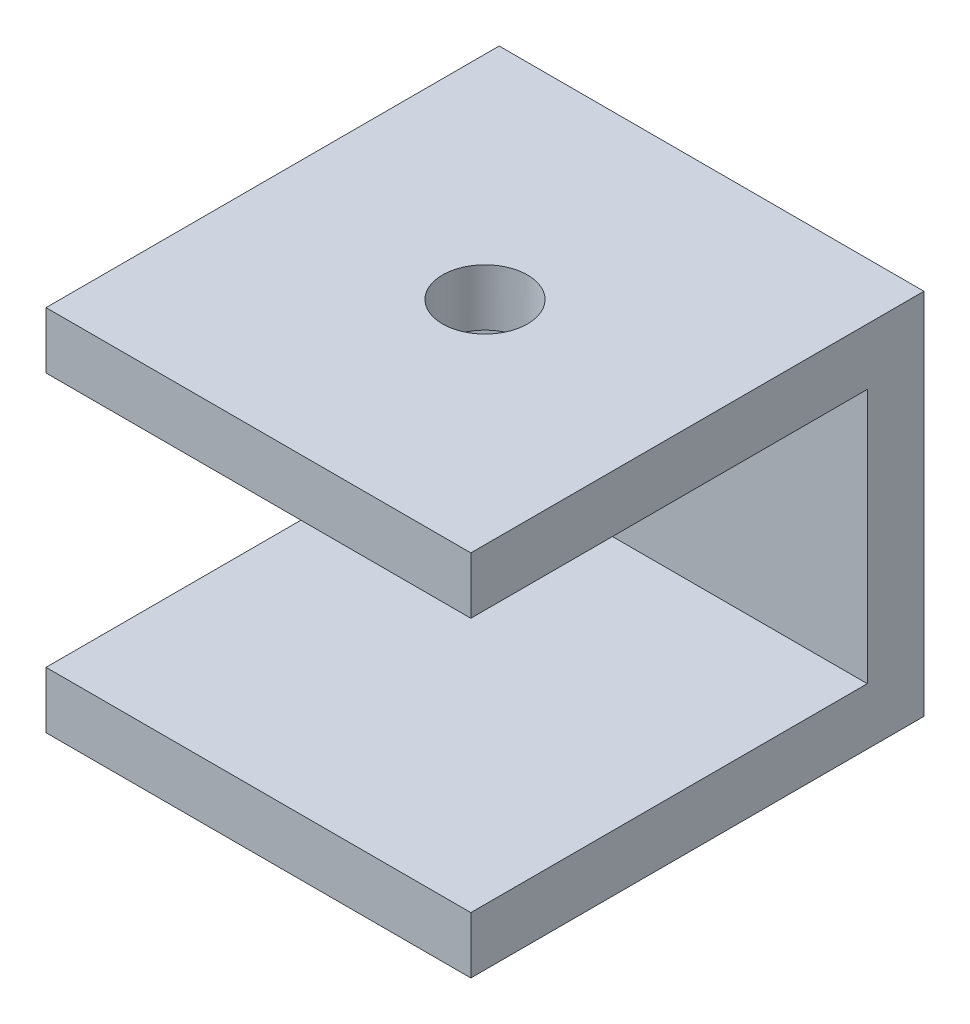
ISO-10303-21;
HEADER;
FILE_DESCRIPTION(('STEP AP214'),'2;1');
FILE_NAME('part.step','',(''),(''),'','','');
FILE_SCHEMA(('AUTOMOTIVE_DESIGN { 1 0 10303 214 1 1 1 1 }'));
ENDSEC;
DATA;
#1=APPLICATION_CONTEXT('core data for automotive mechanical design processes');
#2=APPLICATION_PROTOCOL_DEFINITION('international standard','automotive_design',2000,#1);
#3=PRODUCT_CONTEXT('',#1,'mechanical');
#4=PRODUCT('Part','Part','',(#3));
#5=PRODUCT_RELATED_PRODUCT_CATEGORY('part','',(#4));
#6=PRODUCT_DEFINITION_FORMATION('','',#4);
#7=PRODUCT_DEFINITION_CONTEXT('part definition',#1,'design');
#8=PRODUCT_DEFINITION('design','',#6,#7);
#9=PRODUCT_DEFINITION_SHAPE('','',#8);
#10=(LENGTH_UNIT() NAMED_UNIT(*) SI_UNIT(.MILLI.,.METRE.));
#11=(NAMED_UNIT(*) PLANE_ANGLE_UNIT() SI_UNIT($,.RADIAN.));
#12=(NAMED_UNIT(*) SI_UNIT($,.STERADIAN.) SOLID_ANGLE_UNIT());
#13=UNCERTAINTY_MEASURE_WITH_UNIT(LENGTH_MEASURE(1.E-05),#10,'distance_accuracy_value','');
#14=(GEOMETRIC_REPRESENTATION_CONTEXT(3) GLOBAL_UNCERTAINTY_ASSIGNED_CONTEXT((#13)) GLOBAL_UNIT_ASSIGNED_CONTEXT((#10,
#11,#12)) REPRESENTATION_CONTEXT('',''));
#15=CARTESIAN_POINT('',(0.,0.,0.));
#16=DIRECTION('',(0.,0.,1.));
#17=DIRECTION('',(1.,0.,0.));
#18=AXIS2_PLACEMENT_3D('',#15,#16,#17);
#19=CARTESIAN_POINT('',(-15.,0.,16.));
#20=DIRECTION('',(0.,1.,0.));
#21=DIRECTION('',(0.,0.,1.));
#22=AXIS2_PLACEMENT_3D('',#19,#20,#21);
#23=PLANE('',#22);
#24=CARTESIAN_POINT('',(-7.5,0.,8.));
#25=DIRECTION('',(0.,1.,0.));
#26=DIRECTION('',(0.,0.,1.));
#27=AXIS2_PLACEMENT_3D('',#24,#25,#26);
#28=CIRCLE('',#27,1.5);
#29=CARTESIAN_POINT('',(-7.5,0.,9.5));
#30=VERTEX_POINT('',#29);
#31=EDGE_CURVE('E134',#30,#30,#28,.T.);
#32=ORIENTED_EDGE('',*,*,#31,.F.);
#33=EDGE_LOOP('',(#32));
#34=FACE_BOUND('',#33,.T.);
#35=DIRECTION('',(0.,0.,1.));
#36=VECTOR('',#35,1.);
#37=CARTESIAN_POINT('',(0.,0.,16.));
#38=LINE('',#37,#36);
#39=CARTESIAN_POINT('',(0.,0.,0.));
#40=VERTEX_POINT('',#39);
#41=CARTESIAN_POINT('',(0.,0.,16.));
#42=VERTEX_POINT('',#41);
#43=EDGE_CURVE('E130',#40,#42,#38,.T.);
#44=ORIENTED_EDGE('',*,*,#43,.F.);
#45=DIRECTION('',(1.,0.,0.));
#46=VECTOR('',#45,1.);
#47=CARTESIAN_POINT('',(-15.,0.,0.));
#48=LINE('',#47,#46);
#49=CARTESIAN_POINT('',(-15.,0.,0.));
#50=VERTEX_POINT('',#49);
#51=EDGE_CURVE('E11',#50,#40,#48,.T.);
#52=ORIENTED_EDGE('',*,*,#51,.F.);
#53=DIRECTION('',(0.,0.,1.));
#54=VECTOR('',#53,1.);
#55=CARTESIAN_POINT('',(-15.,0.,16.));
#56=LINE('',#55,#54);
#57=CARTESIAN_POINT('',(-15.,0.,16.));
#58=VERTEX_POINT('',#57);
#59=EDGE_CURVE('E151',#50,#58,#56,.T.);
#60=ORIENTED_EDGE('',*,*,#59,.T.);
#61=DIRECTION('',(1.,0.,0.));
#62=VECTOR('',#61,1.);
#63=CARTESIAN_POINT('',(-15.,0.,16.));
#64=LINE('',#63,#62);
#65=EDGE_CURVE('E36',#58,#42,#64,.T.);
#66=ORIENTED_EDGE('',*,*,#65,.T.);
#67=EDGE_LOOP('',(#44,#52,#60,#66));
#68=FACE_BOUND('',#67,.T.);
#69=ADVANCED_FACE('F33',(#34,#68),#23,.T.);
#70=CARTESIAN_POINT('',(-15.,0.,0.));
#71=DIRECTION('',(0.,0.,-1.));
#72=DIRECTION('',(0.,1.,0.));
#73=AXIS2_PLACEMENT_3D('',#70,#71,#72);
#74=PLANE('',#73);
#75=DIRECTION('',(0.,1.,0.));
#76=VECTOR('',#75,1.);
#77=CARTESIAN_POINT('',(0.,0.,0.));
#78=LINE('',#77,#76);
#79=CARTESIAN_POINT('',(0.,-13.,0.));
#80=VERTEX_POINT('',#79);
#81=EDGE_CURVE('E149',#80,#40,#78,.T.);
#82=ORIENTED_EDGE('',*,*,#81,.F.);
#83=DIRECTION('',(1.,0.,0.));
#84=VECTOR('',#83,1.);
#85=CARTESIAN_POINT('',(-15.,-13.,0.));
#86=LINE('',#85,#84);
#87=CARTESIAN_POINT('',(-15.,-13.,0.));
#88=VERTEX_POINT('',#87);
#89=EDGE_CURVE('E42',#88,#80,#86,.T.);
#90=ORIENTED_EDGE('',*,*,#89,.F.);
#91=DIRECTION('',(0.,1.,0.));
#92=VECTOR('',#91,1.);
#93=CARTESIAN_POINT('',(-15.,0.,0.));
#94=LINE('',#93,#92);
#95=EDGE_CURVE('E120',#88,#50,#94,.T.);
#96=ORIENTED_EDGE('',*,*,#95,.T.);
#97=ORIENTED_EDGE('',*,*,#51,.T.);
#98=EDGE_LOOP('',(#82,#90,#96,#97));
#99=FACE_BOUND('',#98,.T.);
#100=ADVANCED_FACE('F163',(#99),#74,.T.);
#101=CARTESIAN_POINT('',(-15.,-13.,0.));
#102=DIRECTION('',(0.,-1.,0.));
#103=DIRECTION('',(0.,0.,-1.));
#104=AXIS2_PLACEMENT_3D('',#101,#102,#103);
#105=PLANE('',#104);
#106=DIRECTION('',(0.,0.,-1.));
#107=VECTOR('',#106,1.);
#108=CARTESIAN_POINT('',(0.,-13.,0.));
#109=LINE('',#108,#107);
#110=CARTESIAN_POINT('',(0.,-13.,16.));
#111=VERTEX_POINT('',#110);
#112=EDGE_CURVE('E107',#111,#80,#109,.T.);
#113=ORIENTED_EDGE('',*,*,#112,.F.);
#114=DIRECTION('',(1.,0.,0.));
#115=VECTOR('',#114,1.);
#116=CARTESIAN_POINT('',(-15.,-13.,16.));
#117=LINE('',#116,#115);
#118=CARTESIAN_POINT('',(-15.,-13.,16.));
#119=VERTEX_POINT('',#118);
#120=EDGE_CURVE('E102',#119,#111,#117,.T.);
#121=ORIENTED_EDGE('',*,*,#120,.F.);
#122=DIRECTION('',(0.,0.,-1.));
#123=VECTOR('',#122,1.);
#124=CARTESIAN_POINT('',(-15.,-13.,0.));
#125=LINE('',#124,#123);
#126=EDGE_CURVE('E105',#119,#88,#125,.T.);
#127=ORIENTED_EDGE('',*,*,#126,.T.);
#128=ORIENTED_EDGE('',*,*,#89,.T.);
#129=EDGE_LOOP('',(#113,#121,#127,#128));
#130=FACE_BOUND('',#129,.T.);
#131=ADVANCED_FACE('F104',(#130),#105,.T.);
#132=CARTESIAN_POINT('',(-15.,-13.,16.));
#133=DIRECTION('',(0.,0.,1.));
#134=DIRECTION('',(0.,-1.,0.));
#135=AXIS2_PLACEMENT_3D('',#132,#133,#134);
#136=PLANE('',#135);
#137=DIRECTION('',(0.,-1.,0.));
#138=VECTOR('',#137,1.);
#139=CARTESIAN_POINT('',(0.,-13.,16.));
#140=LINE('',#139,#138);
#141=CARTESIAN_POINT('',(0.,-11.,16.));
#142=VERTEX_POINT('',#141);
#143=EDGE_CURVE('E146',#142,#111,#140,.T.);
#144=ORIENTED_EDGE('',*,*,#143,.F.);
#145=DIRECTION('',(1.,0.,0.));
#146=VECTOR('',#145,1.);
#147=CARTESIAN_POINT('',(-15.,-11.,16.));
#148=LINE('',#147,#146);
#149=CARTESIAN_POINT('',(-15.,-11.,16.));
#150=VERTEX_POINT('',#149);
#151=EDGE_CURVE('E112',#150,#142,#148,.T.);
#152=ORIENTED_EDGE('',*,*,#151,.F.);
#153=DIRECTION('',(0.,-1.,0.));
#154=VECTOR('',#153,1.);
#155=CARTESIAN_POINT('',(-15.,-13.,16.));
#156=LINE('',#155,#154);
#157=EDGE_CURVE('E118',#150,#119,#156,.T.);
#158=ORIENTED_EDGE('',*,*,#157,.T.);
#159=ORIENTED_EDGE('',*,*,#120,.T.);
#160=EDGE_LOOP('',(#144,#152,#158,#159));
#161=FACE_BOUND('',#160,.T.);
#162=ADVANCED_FACE('F122',(#161),#136,.T.);
#163=CARTESIAN_POINT('',(-15.,-11.,16.));
#164=DIRECTION('',(0.,1.,0.));
#165=DIRECTION('',(0.,0.,1.));
#166=AXIS2_PLACEMENT_3D('',#163,#164,#165);
#167=PLANE('',#166);
#168=DIRECTION('',(0.,0.,1.));
#169=VECTOR('',#168,1.);
#170=CARTESIAN_POINT('',(0.,-11.,16.));
#171=LINE('',#170,#169);
#172=CARTESIAN_POINT('',(0.,-11.,2.));
#173=VERTEX_POINT('',#172);
#174=EDGE_CURVE('E143',#173,#142,#171,.T.);
#175=ORIENTED_EDGE('',*,*,#174,.F.);
#176=DIRECTION('',(1.,0.,0.));
#177=VECTOR('',#176,1.);
#178=CARTESIAN_POINT('',(-15.,-11.,2.));
#179=LINE('',#178,#177);
#180=CARTESIAN_POINT('',(-15.,-11.,2.));
#181=VERTEX_POINT('',#180);
#182=EDGE_CURVE('E155',#181,#173,#179,.T.);
#183=ORIENTED_EDGE('',*,*,#182,.F.);
#184=DIRECTION('',(0.,0.,1.));
#185=VECTOR('',#184,1.);
#186=CARTESIAN_POINT('',(-15.,-11.,16.));
#187=LINE('',#186,#185);
#188=EDGE_CURVE('E123',#181,#150,#187,.T.);
#189=ORIENTED_EDGE('',*,*,#188,.T.);
#190=ORIENTED_EDGE('',*,*,#151,.T.);
#191=EDGE_LOOP('',(#175,#183,#189,#190));
#192=FACE_BOUND('',#191,.T.);
#193=ADVANCED_FACE('F177',(#192),#167,.T.);
#194=CARTESIAN_POINT('',(-15.,-11.,2.));
#195=DIRECTION('',(0.,0.,1.));
#196=DIRECTION('',(0.,-1.,0.));
#197=AXIS2_PLACEMENT_3D('',#194,#195,#196);
#198=PLANE('',#197);
#199=DIRECTION('',(0.,-1.,0.));
#200=VECTOR('',#199,1.);
#201=CARTESIAN_POINT('',(0.,-11.,2.));
#202=LINE('',#201,#200);
#203=CARTESIAN_POINT('',(0.,-2.,2.));
#204=VERTEX_POINT('',#203);
#205=EDGE_CURVE('E140',#204,#173,#202,.T.);
#206=ORIENTED_EDGE('',*,*,#205,.F.);
#207=DIRECTION('',(1.,0.,0.));
#208=VECTOR('',#207,1.);
#209=CARTESIAN_POINT('',(-15.,-2.,2.));
#210=LINE('',#209,#208);
#211=CARTESIAN_POINT('',(-15.,-2.,2.));
#212=VERTEX_POINT('',#211);
#213=EDGE_CURVE('E157',#212,#204,#210,.T.);
#214=ORIENTED_EDGE('',*,*,#213,.F.);
#215=DIRECTION('',(0.,-1.,0.));
#216=VECTOR('',#215,1.);
#217=CARTESIAN_POINT('',(-15.,-11.,2.));
#218=LINE('',#217,#216);
#219=EDGE_CURVE('E125',#212,#181,#218,.T.);
#220=ORIENTED_EDGE('',*,*,#219,.T.);
#221=ORIENTED_EDGE('',*,*,#182,.T.);
#222=EDGE_LOOP('',(#206,#214,#220,#221));
#223=FACE_BOUND('',#222,.T.);
#224=ADVANCED_FACE('F180',(#223),#198,.T.);
#225=CARTESIAN_POINT('',(-15.,-2.,2.));
#226=DIRECTION('',(0.,-1.,0.));
#227=DIRECTION('',(0.,0.,-1.));
#228=AXIS2_PLACEMENT_3D('',#225,#226,#227);
#229=PLANE('',#228);
#230=CARTESIAN_POINT('',(-7.5,-2.,8.));
#231=DIRECTION('',(0.,-1.,0.));
#232=DIRECTION('',(0.,0.,-1.));
#233=AXIS2_PLACEMENT_3D('',#230,#231,#232);
#234=CIRCLE('',#233,1.5);
#235=CARTESIAN_POINT('',(-7.5,-2.,6.5));
#236=VERTEX_POINT('',#235);
#237=EDGE_CURVE('E204',#236,#236,#234,.F.);
#238=ORIENTED_EDGE('',*,*,#237,.T.);
#239=EDGE_LOOP('',(#238));
#240=FACE_BOUND('',#239,.T.);
#241=DIRECTION('',(0.,0.,-1.));
#242=VECTOR('',#241,1.);
#243=CARTESIAN_POINT('',(0.,-2.,2.));
#244=LINE('',#243,#242);
#245=CARTESIAN_POINT('',(0.,-2.,16.));
#246=VERTEX_POINT('',#245);
#247=EDGE_CURVE('E137',#246,#204,#244,.T.);
#248=ORIENTED_EDGE('',*,*,#247,.F.);
#249=DIRECTION('',(1.,0.,0.));
#250=VECTOR('',#249,1.);
#251=CARTESIAN_POINT('',(-15.,-2.,16.));
#252=LINE('',#251,#250);
#253=CARTESIAN_POINT('',(-15.,-2.,16.));
#254=VERTEX_POINT('',#253);
#255=EDGE_CURVE('E158',#254,#246,#252,.T.);
#256=ORIENTED_EDGE('',*,*,#255,.F.);
#257=DIRECTION('',(0.,0.,-1.));
#258=VECTOR('',#257,1.);
#259=CARTESIAN_POINT('',(-15.,-2.,2.));
#260=LINE('',#259,#258);
#261=EDGE_CURVE('E213',#254,#212,#260,.T.);
#262=ORIENTED_EDGE('',*,*,#261,.T.);
#263=ORIENTED_EDGE('',*,*,#213,.T.);
#264=EDGE_LOOP('',(#248,#256,#262,#263));
#265=FACE_BOUND('',#264,.T.);
#266=ADVANCED_FACE('F184',(#240,#265),#229,.T.);
#267=CARTESIAN_POINT('',(-15.,-2.,16.));
#268=DIRECTION('',(0.,0.,1.));
#269=DIRECTION('',(1.,0.,0.));
#270=AXIS2_PLACEMENT_3D('',#267,#268,#269);
#271=PLANE('',#270);
#272=DIRECTION('',(0.,-1.,0.));
#273=VECTOR('',#272,1.);
#274=CARTESIAN_POINT('',(0.,-2.,16.));
#275=LINE('',#274,#273);
#276=EDGE_CURVE('E133',#42,#246,#275,.T.);
#277=ORIENTED_EDGE('',*,*,#276,.F.);
#278=ORIENTED_EDGE('',*,*,#65,.F.);
#279=DIRECTION('',(0.,-1.,0.));
#280=VECTOR('',#279,1.);
#281=CARTESIAN_POINT('',(-15.,-2.,16.));
#282=LINE('',#281,#280);
#283=EDGE_CURVE('E211',#58,#254,#282,.T.);
#284=ORIENTED_EDGE('',*,*,#283,.T.);
#285=ORIENTED_EDGE('',*,*,#255,.T.);
#286=EDGE_LOOP('',(#277,#278,#284,#285));
#287=FACE_BOUND('',#286,.T.);
#288=ADVANCED_FACE('F160',(#287),#271,.T.);
#289=CARTESIAN_POINT('',(-15.,0.,0.));
#290=DIRECTION('',(-1.,0.,0.));
#291=DIRECTION('',(0.,0.,1.));
#292=AXIS2_PLACEMENT_3D('',#289,#290,#291);
#293=PLANE('',#292);
#294=ORIENTED_EDGE('',*,*,#59,.F.);
#295=ORIENTED_EDGE('',*,*,#95,.F.);
#296=ORIENTED_EDGE('',*,*,#126,.F.);
#297=ORIENTED_EDGE('',*,*,#157,.F.);
#298=ORIENTED_EDGE('',*,*,#188,.F.);
#299=ORIENTED_EDGE('',*,*,#219,.F.);
#300=ORIENTED_EDGE('',*,*,#261,.F.);
#301=ORIENTED_EDGE('',*,*,#283,.F.);
#302=EDGE_LOOP('',(#294,#295,#296,#297,#298,#299,#300,#301));
#303=FACE_BOUND('',#302,.T.);
#304=ADVANCED_FACE('F116',(#303),#293,.T.);
#305=CARTESIAN_POINT('',(0.,0.,0.));
#306=DIRECTION('',(-1.,0.,0.));
#307=DIRECTION('',(0.,0.,1.));
#308=AXIS2_PLACEMENT_3D('',#305,#306,#307);
#309=PLANE('',#308);
#310=ORIENTED_EDGE('',*,*,#43,.T.);
#311=ORIENTED_EDGE('',*,*,#276,.T.);
#312=ORIENTED_EDGE('',*,*,#247,.T.);
#313=ORIENTED_EDGE('',*,*,#205,.T.);
#314=ORIENTED_EDGE('',*,*,#174,.T.);
#315=ORIENTED_EDGE('',*,*,#143,.T.);
#316=ORIENTED_EDGE('',*,*,#112,.T.);
#317=ORIENTED_EDGE('',*,*,#81,.T.);
#318=EDGE_LOOP('',(#310,#311,#312,#313,#314,#315,#316,#317));
#319=FACE_BOUND('',#318,.T.);
#320=ADVANCED_FACE('F162',(#319),#309,.F.);
#321=CARTESIAN_POINT('',(-7.5,-13.001,8.));
#322=DIRECTION('',(0.,1.,0.));
#323=DIRECTION('',(0.,0.,1.));
#324=AXIS2_PLACEMENT_3D('',#321,#322,#323);
#325=CYLINDRICAL_SURFACE('',#324,1.5);
#326=ORIENTED_EDGE('',*,*,#237,.F.);
#327=EDGE_LOOP('',(#326));
#328=FACE_BOUND('',#327,.T.);
#329=ORIENTED_EDGE('',*,*,#31,.T.);
#330=EDGE_LOOP('',(#329));
#331=FACE_BOUND('',#330,.T.);
#332=ADVANCED_FACE('F195',(#328,#331),#325,.F.);
#333=CLOSED_SHELL('',(#69,#100,#131,#162,#193,#224,#266,#288,#304,#320,#332));
#334=MANIFOLD_SOLID_BREP('B2',#333);
#335=ADVANCED_BREP_SHAPE_REPRESENTATION('',(#18,#334),#14);
#336=SHAPE_DEFINITION_REPRESENTATION(#9,#335);
ENDSEC;
END-ISO-10303-21;
